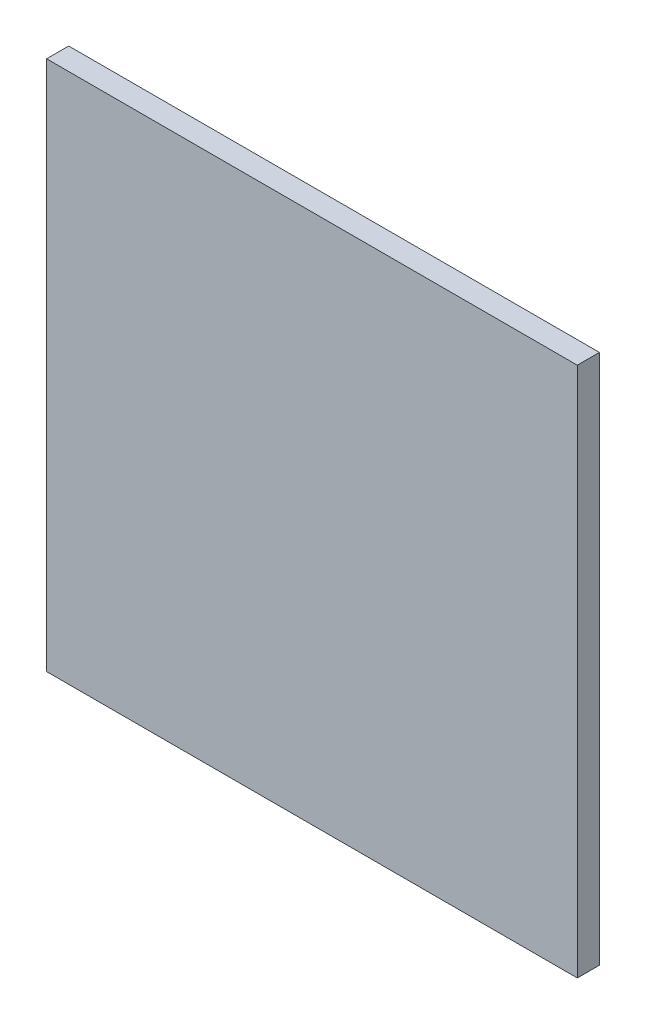
ISO-10303-21;
HEADER;
FILE_DESCRIPTION(('STEP AP214'),'2;1');
FILE_NAME('part.step','',(''),(''),'','','');
FILE_SCHEMA(('AUTOMOTIVE_DESIGN { 1 0 10303 214 1 1 1 1 }'));
ENDSEC;
DATA;
#1=APPLICATION_CONTEXT('core data for automotive mechanical design processes');
#2=APPLICATION_PROTOCOL_DEFINITION('international standard','automotive_design',2000,#1);
#3=PRODUCT_CONTEXT('',#1,'mechanical');
#4=PRODUCT('Part','Part','',(#3));
#5=PRODUCT_RELATED_PRODUCT_CATEGORY('part','',(#4));
#6=PRODUCT_DEFINITION_FORMATION('','',#4);
#7=PRODUCT_DEFINITION_CONTEXT('part definition',#1,'design');
#8=PRODUCT_DEFINITION('design','',#6,#7);
#9=PRODUCT_DEFINITION_SHAPE('','',#8);
#10=(LENGTH_UNIT() NAMED_UNIT(*) SI_UNIT(.MILLI.,.METRE.));
#11=(NAMED_UNIT(*) PLANE_ANGLE_UNIT() SI_UNIT($,.RADIAN.));
#12=(NAMED_UNIT(*) SI_UNIT($,.STERADIAN.) SOLID_ANGLE_UNIT());
#13=UNCERTAINTY_MEASURE_WITH_UNIT(LENGTH_MEASURE(1.E-05),#10,'distance_accuracy_value','');
#14=(GEOMETRIC_REPRESENTATION_CONTEXT(3) GLOBAL_UNCERTAINTY_ASSIGNED_CONTEXT((#13)) GLOBAL_UNIT_ASSIGNED_CONTEXT((#10,
#11,#12)) REPRESENTATION_CONTEXT('',''));
#15=CARTESIAN_POINT('',(0.,0.,0.));
#16=DIRECTION('',(0.,0.,1.));
#17=DIRECTION('',(1.,0.,0.));
#18=AXIS2_PLACEMENT_3D('',#15,#16,#17);
#19=CARTESIAN_POINT('',(-213.139130434783,-92.2130434782609,12.7));
#20=DIRECTION('',(1.,0.,0.));
#21=DIRECTION('',(0.,0.,-1.));
#22=AXIS2_PLACEMENT_3D('',#19,#20,#21);
#23=PLANE('',#22);
#24=DIRECTION('',(0.,-1.,0.));
#25=VECTOR('',#24,1.);
#26=CARTESIAN_POINT('',(-213.139130434783,-92.2130434782609,0.));
#27=LINE('',#26,#25);
#28=CARTESIAN_POINT('',(-213.139130434783,212.586956521739,0.));
#29=VERTEX_POINT('',#28);
#30=CARTESIAN_POINT('',(-213.139130434783,-92.2130434782609,0.));
#31=VERTEX_POINT('',#30);
#32=EDGE_CURVE('E107',#29,#31,#27,.T.);
#33=ORIENTED_EDGE('',*,*,#32,.T.);
#34=DIRECTION('',(0.,0.,-1.));
#35=VECTOR('',#34,1.);
#36=CARTESIAN_POINT('',(-213.139130434783,-92.2130434782609,12.7));
#37=LINE('',#36,#35);
#38=CARTESIAN_POINT('',(-213.139130434783,-92.2130434782609,12.7));
#39=VERTEX_POINT('',#38);
#40=EDGE_CURVE('E11',#39,#31,#37,.T.);
#41=ORIENTED_EDGE('',*,*,#40,.F.);
#42=DIRECTION('',(0.,-1.,0.));
#43=VECTOR('',#42,1.);
#44=CARTESIAN_POINT('',(-213.139130434783,-92.2130434782609,12.7));
#45=LINE('',#44,#43);
#46=CARTESIAN_POINT('',(-213.139130434783,212.586956521739,12.7));
#47=VERTEX_POINT('',#46);
#48=EDGE_CURVE('E91',#47,#39,#45,.T.);
#49=ORIENTED_EDGE('',*,*,#48,.F.);
#50=DIRECTION('',(0.,0.,-1.));
#51=VECTOR('',#50,1.);
#52=CARTESIAN_POINT('',(-213.139130434783,212.586956521739,12.7));
#53=LINE('',#52,#51);
#54=EDGE_CURVE('E103',#47,#29,#53,.T.);
#55=ORIENTED_EDGE('',*,*,#54,.T.);
#56=EDGE_LOOP('',(#33,#41,#49,#55));
#57=FACE_BOUND('',#56,.T.);
#58=ADVANCED_FACE('F39',(#57),#23,.F.);
#59=CARTESIAN_POINT('',(-213.139130434783,-92.2130434782609,12.7));
#60=DIRECTION('',(0.,1.,0.));
#61=DIRECTION('',(0.,0.,1.));
#62=AXIS2_PLACEMENT_3D('',#59,#60,#61);
#63=PLANE('',#62);
#64=DIRECTION('',(1.,0.,0.));
#65=VECTOR('',#64,1.);
#66=CARTESIAN_POINT('',(-213.139130434783,-92.2130434782609,0.));
#67=LINE('',#66,#65);
#68=CARTESIAN_POINT('',(91.6608695652174,-92.2130434782609,0.));
#69=VERTEX_POINT('',#68);
#70=EDGE_CURVE('E96',#31,#69,#67,.T.);
#71=ORIENTED_EDGE('',*,*,#70,.T.);
#72=DIRECTION('',(0.,0.,-1.));
#73=VECTOR('',#72,1.);
#74=CARTESIAN_POINT('',(91.6608695652174,-92.2130434782609,12.7));
#75=LINE('',#74,#73);
#76=CARTESIAN_POINT('',(91.6608695652174,-92.2130434782609,12.7));
#77=VERTEX_POINT('',#76);
#78=EDGE_CURVE('E48',#77,#69,#75,.T.);
#79=ORIENTED_EDGE('',*,*,#78,.F.);
#80=DIRECTION('',(1.,0.,0.));
#81=VECTOR('',#80,1.);
#82=CARTESIAN_POINT('',(-213.139130434783,-92.2130434782609,12.7));
#83=LINE('',#82,#81);
#84=EDGE_CURVE('E86',#39,#77,#83,.T.);
#85=ORIENTED_EDGE('',*,*,#84,.F.);
#86=ORIENTED_EDGE('',*,*,#40,.T.);
#87=EDGE_LOOP('',(#71,#79,#85,#86));
#88=FACE_BOUND('',#87,.T.);
#89=ADVANCED_FACE('F95',(#88),#63,.F.);
#90=CARTESIAN_POINT('',(91.6608695652174,-92.2130434782609,12.7));
#91=DIRECTION('',(-1.,0.,0.));
#92=DIRECTION('',(0.,0.,1.));
#93=AXIS2_PLACEMENT_3D('',#90,#91,#92);
#94=PLANE('',#93);
#95=DIRECTION('',(0.,1.,0.));
#96=VECTOR('',#95,1.);
#97=CARTESIAN_POINT('',(91.6608695652174,-92.2130434782609,0.));
#98=LINE('',#97,#96);
#99=CARTESIAN_POINT('',(91.6608695652174,212.586956521739,0.));
#100=VERTEX_POINT('',#99);
#101=EDGE_CURVE('E73',#69,#100,#98,.T.);
#102=ORIENTED_EDGE('',*,*,#101,.T.);
#103=DIRECTION('',(0.,0.,-1.));
#104=VECTOR('',#103,1.);
#105=CARTESIAN_POINT('',(91.6608695652174,212.586956521739,12.7));
#106=LINE('',#105,#104);
#107=CARTESIAN_POINT('',(91.6608695652174,212.586956521739,12.7));
#108=VERTEX_POINT('',#107);
#109=EDGE_CURVE('E98',#108,#100,#106,.T.);
#110=ORIENTED_EDGE('',*,*,#109,.F.);
#111=DIRECTION('',(0.,1.,0.));
#112=VECTOR('',#111,1.);
#113=CARTESIAN_POINT('',(91.6608695652174,-92.2130434782609,12.7));
#114=LINE('',#113,#112);
#115=EDGE_CURVE('E89',#77,#108,#114,.T.);
#116=ORIENTED_EDGE('',*,*,#115,.F.);
#117=ORIENTED_EDGE('',*,*,#78,.T.);
#118=EDGE_LOOP('',(#102,#110,#116,#117));
#119=FACE_BOUND('',#118,.T.);
#120=ADVANCED_FACE('F99',(#119),#94,.F.);
#121=CARTESIAN_POINT('',(-213.139130434783,212.586956521739,12.7));
#122=DIRECTION('',(0.,-1.,0.));
#123=DIRECTION('',(0.,0.,-1.));
#124=AXIS2_PLACEMENT_3D('',#121,#122,#123);
#125=PLANE('',#124);
#126=DIRECTION('',(-1.,0.,0.));
#127=VECTOR('',#126,1.);
#128=CARTESIAN_POINT('',(-213.139130434783,212.586956521739,0.));
#129=LINE('',#128,#127);
#130=EDGE_CURVE('E79',#100,#29,#129,.T.);
#131=ORIENTED_EDGE('',*,*,#130,.T.);
#132=ORIENTED_EDGE('',*,*,#54,.F.);
#133=DIRECTION('',(-1.,0.,0.));
#134=VECTOR('',#133,1.);
#135=CARTESIAN_POINT('',(-213.139130434783,212.586956521739,12.7));
#136=LINE('',#135,#134);
#137=EDGE_CURVE('E56',#108,#47,#136,.T.);
#138=ORIENTED_EDGE('',*,*,#137,.F.);
#139=ORIENTED_EDGE('',*,*,#109,.T.);
#140=EDGE_LOOP('',(#131,#132,#138,#139));
#141=FACE_BOUND('',#140,.T.);
#142=ADVANCED_FACE('F120',(#141),#125,.F.);
#143=CARTESIAN_POINT('',(0.,0.,12.7));
#144=DIRECTION('',(0.,0.,-1.));
#145=DIRECTION('',(-1.,0.,0.));
#146=AXIS2_PLACEMENT_3D('',#143,#144,#145);
#147=PLANE('',#146);
#148=ORIENTED_EDGE('',*,*,#48,.T.);
#149=ORIENTED_EDGE('',*,*,#84,.T.);
#150=ORIENTED_EDGE('',*,*,#115,.T.);
#151=ORIENTED_EDGE('',*,*,#137,.T.);
#152=EDGE_LOOP('',(#148,#149,#150,#151));
#153=FACE_BOUND('',#152,.T.);
#154=ADVANCED_FACE('F87',(#153),#147,.F.);
#155=CARTESIAN_POINT('',(0.,0.,0.));
#156=DIRECTION('',(0.,0.,-1.));
#157=DIRECTION('',(-1.,0.,0.));
#158=AXIS2_PLACEMENT_3D('',#155,#156,#157);
#159=PLANE('',#158);
#160=ORIENTED_EDGE('',*,*,#32,.F.);
#161=ORIENTED_EDGE('',*,*,#130,.F.);
#162=ORIENTED_EDGE('',*,*,#101,.F.);
#163=ORIENTED_EDGE('',*,*,#70,.F.);
#164=EDGE_LOOP('',(#160,#161,#162,#163));
#165=FACE_BOUND('',#164,.T.);
#166=ADVANCED_FACE('F123',(#165),#159,.T.);
#167=CLOSED_SHELL('',(#58,#89,#120,#142,#154,#166));
#168=MANIFOLD_SOLID_BREP('B2',#167);
#169=ADVANCED_BREP_SHAPE_REPRESENTATION('',(#18,#168),#14);
#170=SHAPE_DEFINITION_REPRESENTATION(#9,#169);
ENDSEC;
END-ISO-10303-21;
